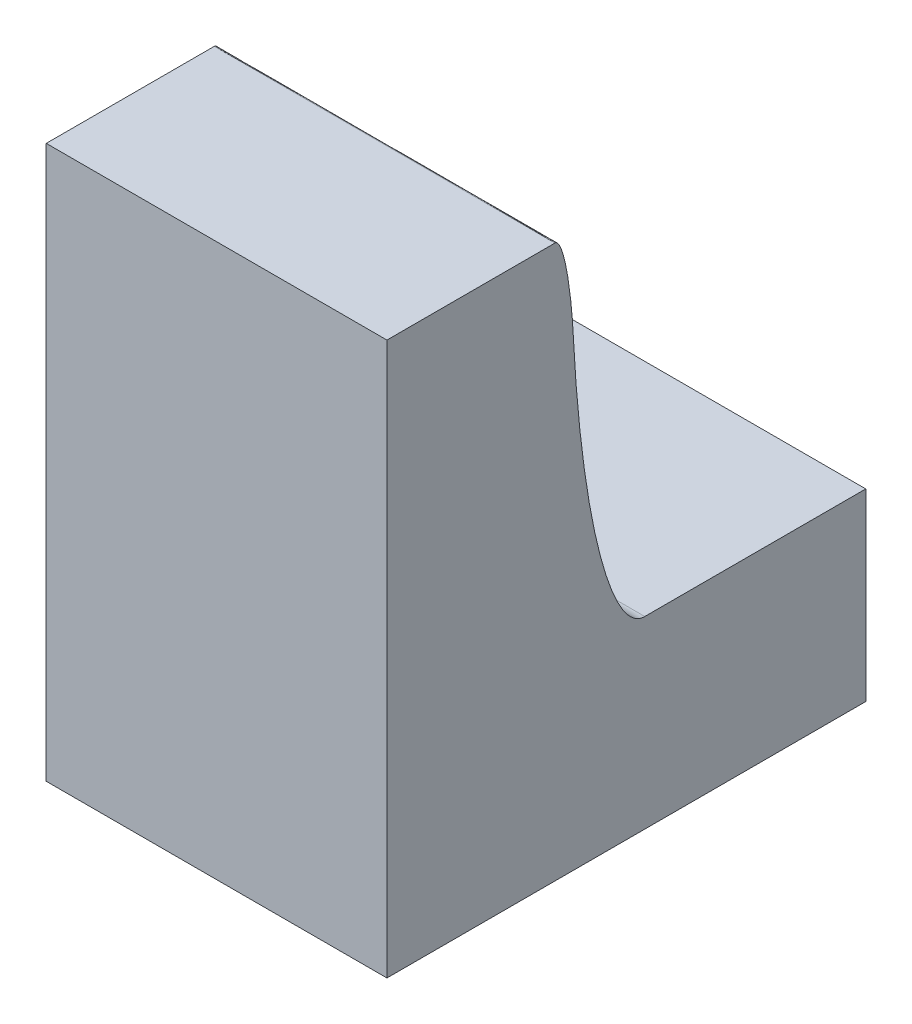
ISO-10303-21;
HEADER;
FILE_DESCRIPTION(('STEP AP214'),'2;1');
FILE_NAME('part.step','',(''),(''),'','','');
FILE_SCHEMA(('AUTOMOTIVE_DESIGN { 1 0 10303 214 1 1 1 1 }'));
ENDSEC;
DATA;
#1=APPLICATION_CONTEXT('core data for automotive mechanical design processes');
#2=APPLICATION_PROTOCOL_DEFINITION('international standard','automotive_design',2000,#1);
#3=PRODUCT_CONTEXT('',#1,'mechanical');
#4=PRODUCT('Part','Part','',(#3));
#5=PRODUCT_RELATED_PRODUCT_CATEGORY('part','',(#4));
#6=PRODUCT_DEFINITION_FORMATION('','',#4);
#7=PRODUCT_DEFINITION_CONTEXT('part definition',#1,'design');
#8=PRODUCT_DEFINITION('design','',#6,#7);
#9=PRODUCT_DEFINITION_SHAPE('','',#8);
#10=(LENGTH_UNIT() NAMED_UNIT(*) SI_UNIT(.MILLI.,.METRE.));
#11=(NAMED_UNIT(*) PLANE_ANGLE_UNIT() SI_UNIT($,.RADIAN.));
#12=(NAMED_UNIT(*) SI_UNIT($,.STERADIAN.) SOLID_ANGLE_UNIT());
#13=UNCERTAINTY_MEASURE_WITH_UNIT(LENGTH_MEASURE(1.E-05),#10,'distance_accuracy_value','');
#14=(GEOMETRIC_REPRESENTATION_CONTEXT(3) GLOBAL_UNCERTAINTY_ASSIGNED_CONTEXT((#13)) GLOBAL_UNIT_ASSIGNED_CONTEXT((#10,
#11,#12)) REPRESENTATION_CONTEXT('',''));
#15=CARTESIAN_POINT('',(0.,0.,0.));
#16=DIRECTION('',(0.,0.,1.));
#17=DIRECTION('',(1.,0.,0.));
#18=AXIS2_PLACEMENT_3D('',#15,#16,#17);
#19=CARTESIAN_POINT('',(0.,0.,26.));
#20=DIRECTION('',(0.,0.,1.));
#21=DIRECTION('',(1.,0.,0.));
#22=AXIS2_PLACEMENT_3D('',#19,#20,#21);
#23=PLANE('',#22);
#24=DIRECTION('',(-1.,0.,0.));
#25=VECTOR('',#24,1.);
#26=CARTESIAN_POINT('',(48.5,10.,26.));
#27=LINE('',#26,#25);
#28=CARTESIAN_POINT('',(67.,10.,26.));
#29=VERTEX_POINT('',#28);
#30=CARTESIAN_POINT('',(48.5,10.,26.));
#31=VERTEX_POINT('',#30);
#32=EDGE_CURVE('E110',#29,#31,#27,.T.);
#33=ORIENTED_EDGE('',*,*,#32,.F.);
#34=DIRECTION('',(0.,1.,0.));
#35=VECTOR('',#34,1.);
#36=CARTESIAN_POINT('',(67.,0.,26.));
#37=LINE('',#36,#35);
#38=CARTESIAN_POINT('',(67.,0.,26.));
#39=VERTEX_POINT('',#38);
#40=EDGE_CURVE('E104',#39,#29,#37,.T.);
#41=ORIENTED_EDGE('',*,*,#40,.F.);
#42=DIRECTION('',(1.,0.,0.));
#43=VECTOR('',#42,1.);
#44=CARTESIAN_POINT('',(0.,0.,26.));
#45=LINE('',#44,#43);
#46=CARTESIAN_POINT('',(48.5,0.,26.));
#47=VERTEX_POINT('',#46);
#48=EDGE_CURVE('E37',#47,#39,#45,.T.);
#49=ORIENTED_EDGE('',*,*,#48,.F.);
#50=DIRECTION('',(0.,-1.,0.));
#51=VECTOR('',#50,1.);
#52=CARTESIAN_POINT('',(48.5,0.,26.));
#53=LINE('',#52,#51);
#54=EDGE_CURVE('E94',#31,#47,#53,.T.);
#55=ORIENTED_EDGE('',*,*,#54,.F.);
#56=EDGE_LOOP('',(#33,#41,#49,#55));
#57=FACE_BOUND('',#56,.T.);
#58=ADVANCED_FACE('F34',(#57),#23,.F.);
#59=CARTESIAN_POINT('',(48.5,10.,52.));
#60=DIRECTION('',(0.,-1.,0.));
#61=DIRECTION('',(0.,0.,-1.));
#62=AXIS2_PLACEMENT_3D('',#59,#60,#61);
#63=PLANE('',#62);
#64=DIRECTION('',(0.,0.,-1.));
#65=VECTOR('',#64,1.);
#66=CARTESIAN_POINT('',(67.,10.,52.));
#67=LINE('',#66,#65);
#68=CARTESIAN_POINT('',(67.,10.,38.));
#69=VERTEX_POINT('',#68);
#70=EDGE_CURVE('E117',#69,#29,#67,.T.);
#71=ORIENTED_EDGE('',*,*,#70,.T.);
#72=ORIENTED_EDGE('',*,*,#32,.T.);
#73=DIRECTION('',(0.,0.,-1.));
#74=VECTOR('',#73,1.);
#75=CARTESIAN_POINT('',(48.5,10.,52.));
#76=LINE('',#75,#74);
#77=CARTESIAN_POINT('',(48.5,10.,38.));
#78=VERTEX_POINT('',#77);
#79=EDGE_CURVE('E100',#78,#31,#76,.T.);
#80=ORIENTED_EDGE('',*,*,#79,.F.);
#81=CARTESIAN_POINT('',(67.925,10.,38.));
#82=CARTESIAN_POINT('',(61.1416666666666,10.,38.));
#83=CARTESIAN_POINT('',(54.3583333333333,10.,38.));
#84=CARTESIAN_POINT('',(47.575,10.,38.));
#85=(BOUNDED_CURVE() B_SPLINE_CURVE(3,(#81,#82,#83,#84),.UNSPECIFIED.,.F.,
.F.) B_SPLINE_CURVE_WITH_KNOTS((4,4),(-0.000924999999999999,0.019425),
.UNSPECIFIED.) CURVE() GEOMETRIC_REPRESENTATION_ITEM() RATIONAL_B_SPLINE_CURVE((1.,1.,1.,1.)) REPRESENTATION_ITEM(''));
#86=EDGE_CURVE('E115',#78,#69,#85,.F.);
#87=ORIENTED_EDGE('',*,*,#86,.T.);
#88=EDGE_LOOP('',(#71,#72,#80,#87));
#89=FACE_BOUND('',#88,.T.);
#90=ADVANCED_FACE('F142',(#89),#63,.F.);
#91=CARTESIAN_POINT('',(0.,0.,10.));
#92=DIRECTION('',(0.,1.,0.));
#93=DIRECTION('',(0.,0.,1.));
#94=AXIS2_PLACEMENT_3D('',#91,#92,#93);
#95=PLANE('',#94);
#96=DIRECTION('',(0.,0.,-1.));
#97=VECTOR('',#96,1.);
#98=CARTESIAN_POINT('',(48.5,0.,52.));
#99=LINE('',#98,#97);
#100=CARTESIAN_POINT('',(48.5,0.,52.));
#101=VERTEX_POINT('',#100);
#102=EDGE_CURVE('E98',#101,#47,#99,.T.);
#103=ORIENTED_EDGE('',*,*,#102,.T.);
#104=ORIENTED_EDGE('',*,*,#48,.T.);
#105=DIRECTION('',(0.,0.,-1.));
#106=VECTOR('',#105,1.);
#107=CARTESIAN_POINT('',(67.,0.,52.));
#108=LINE('',#107,#106);
#109=CARTESIAN_POINT('',(67.,0.,52.));
#110=VERTEX_POINT('',#109);
#111=EDGE_CURVE('E114',#110,#39,#108,.T.);
#112=ORIENTED_EDGE('',*,*,#111,.F.);
#113=DIRECTION('',(1.,0.,0.));
#114=VECTOR('',#113,1.);
#115=CARTESIAN_POINT('',(48.5,0.,52.));
#116=LINE('',#115,#114);
#117=EDGE_CURVE('E112',#101,#110,#116,.T.);
#118=ORIENTED_EDGE('',*,*,#117,.F.);
#119=EDGE_LOOP('',(#103,#104,#112,#118));
#120=FACE_BOUND('',#119,.T.);
#121=ADVANCED_FACE('F111',(#120),#95,.F.);
#122=CARTESIAN_POINT('',(48.5,0.,52.));
#123=DIRECTION('',(1.,0.,0.));
#124=DIRECTION('',(0.,0.,-1.));
#125=AXIS2_PLACEMENT_3D('',#122,#123,#124);
#126=PLANE('',#125);
#127=ORIENTED_EDGE('',*,*,#79,.T.);
#128=ORIENTED_EDGE('',*,*,#54,.T.);
#129=ORIENTED_EDGE('',*,*,#102,.F.);
#130=DIRECTION('',(0.,-1.,0.));
#131=VECTOR('',#130,1.);
#132=CARTESIAN_POINT('',(48.5,0.,52.));
#133=LINE('',#132,#131);
#134=CARTESIAN_POINT('',(48.5,30.,52.));
#135=VERTEX_POINT('',#134);
#136=EDGE_CURVE('E203',#135,#101,#133,.T.);
#137=ORIENTED_EDGE('',*,*,#136,.F.);
#138=DIRECTION('',(0.,0.,1.));
#139=VECTOR('',#138,1.);
#140=CARTESIAN_POINT('',(48.5,30.,52.));
#141=LINE('',#140,#139);
#142=CARTESIAN_POINT('',(48.5,30.,42.8743013109692));
#143=VERTEX_POINT('',#142);
#144=EDGE_CURVE('E11',#143,#135,#141,.T.);
#145=ORIENTED_EDGE('',*,*,#144,.F.);
#146=CARTESIAN_POINT('',(48.5,25.0510118754307,41.8756032642306));
#147=CARTESIAN_POINT('',(48.5,29.9999999999986,42.1283895458696));
#148=CARTESIAN_POINT('',(48.5,30.,42.8743013109692));
#149=(BOUNDED_CURVE() B_SPLINE_CURVE(2,(#146,#147,#148),.UNSPECIFIED.,.F.,
.F.) B_SPLINE_CURVE_WITH_KNOTS((3,3),(0.,1.),
.UNSPECIFIED.) CURVE() GEOMETRIC_REPRESENTATION_ITEM() RATIONAL_B_SPLINE_CURVE((1.,
0.72491788342915,1.)) REPRESENTATION_ITEM(''));
#150=CARTESIAN_POINT('',(48.5,25.0510116808237,41.8756070670597));
#151=VERTEX_POINT('',#150);
#152=EDGE_CURVE('E293',#143,#151,#149,.F.);
#153=ORIENTED_EDGE('',*,*,#152,.T.);
#154=CARTESIAN_POINT('',(48.5,10.,38.));
#155=CARTESIAN_POINT('',(48.5,10.,42.));
#156=CARTESIAN_POINT('',(48.5,30.,42.));
#157=(BOUNDED_CURVE() B_SPLINE_CURVE(2,(#154,#155,#156),.UNSPECIFIED.,.F.,
.F.) B_SPLINE_CURVE_WITH_KNOTS((3,3),(0.,1.),
.UNSPECIFIED.) CURVE() GEOMETRIC_REPRESENTATION_ITEM() RATIONAL_B_SPLINE_CURVE((1.,
0.707106781186548,1.)) REPRESENTATION_ITEM(''));
#158=EDGE_CURVE('E119',#151,#78,#157,.F.);
#159=ORIENTED_EDGE('',*,*,#158,.T.);
#160=EDGE_LOOP('',(#127,#128,#129,#137,#145,#153,#159));
#161=FACE_BOUND('',#160,.T.);
#162=ADVANCED_FACE('F96',(#161),#126,.F.);
#163=CARTESIAN_POINT('',(67.,0.,52.));
#164=DIRECTION('',(-1.,0.,0.));
#165=DIRECTION('',(0.,0.,1.));
#166=AXIS2_PLACEMENT_3D('',#163,#164,#165);
#167=PLANE('',#166);
#168=ORIENTED_EDGE('',*,*,#111,.T.);
#169=ORIENTED_EDGE('',*,*,#40,.T.);
#170=ORIENTED_EDGE('',*,*,#70,.F.);
#171=CARTESIAN_POINT('',(67.,30.,42.));
#172=CARTESIAN_POINT('',(67.,10.,42.));
#173=CARTESIAN_POINT('',(67.,10.,38.));
#174=(BOUNDED_CURVE() B_SPLINE_CURVE(2,(#171,#172,#173),.UNSPECIFIED.,.F.,
.F.) B_SPLINE_CURVE_WITH_KNOTS((3,3),(0.,1.),
.UNSPECIFIED.) CURVE() GEOMETRIC_REPRESENTATION_ITEM() RATIONAL_B_SPLINE_CURVE((1.,
0.707106781186548,1.)) REPRESENTATION_ITEM(''));
#175=CARTESIAN_POINT('',(67.,25.0510116842867,41.8756069960222));
#176=VERTEX_POINT('',#175);
#177=EDGE_CURVE('E191',#69,#176,#174,.F.);
#178=ORIENTED_EDGE('',*,*,#177,.T.);
#179=CARTESIAN_POINT('',(67.,30.,42.8743013109748));
#180=CARTESIAN_POINT('',(67.,30.0000000000014,42.1283895458668));
#181=CARTESIAN_POINT('',(67.,25.0510118754324,41.8756032642307));
#182=(BOUNDED_CURVE() B_SPLINE_CURVE(2,(#179,#180,#181),.UNSPECIFIED.,.F.,
.F.) B_SPLINE_CURVE_WITH_KNOTS((3,3),(0.,1.),
.UNSPECIFIED.) CURVE() GEOMETRIC_REPRESENTATION_ITEM() RATIONAL_B_SPLINE_CURVE((1.,
0.72491788342915,1.)) REPRESENTATION_ITEM(''));
#183=CARTESIAN_POINT('',(67.,30.,42.8743013109748));
#184=VERTEX_POINT('',#183);
#185=EDGE_CURVE('E268',#176,#184,#182,.F.);
#186=ORIENTED_EDGE('',*,*,#185,.T.);
#187=DIRECTION('',(0.,0.,-1.));
#188=VECTOR('',#187,1.);
#189=CARTESIAN_POINT('',(67.,30.,52.));
#190=LINE('',#189,#188);
#191=CARTESIAN_POINT('',(67.,30.,52.));
#192=VERTEX_POINT('',#191);
#193=EDGE_CURVE('E196',#192,#184,#190,.T.);
#194=ORIENTED_EDGE('',*,*,#193,.F.);
#195=DIRECTION('',(0.,1.,0.));
#196=VECTOR('',#195,1.);
#197=CARTESIAN_POINT('',(67.,0.,52.));
#198=LINE('',#197,#196);
#199=EDGE_CURVE('E56',#110,#192,#198,.T.);
#200=ORIENTED_EDGE('',*,*,#199,.F.);
#201=EDGE_LOOP('',(#168,#169,#170,#178,#186,#194,#200));
#202=FACE_BOUND('',#201,.T.);
#203=ADVANCED_FACE('F152',(#202),#167,.F.);
#204=CARTESIAN_POINT('',(0.,0.,52.));
#205=DIRECTION('',(0.,0.,-1.));
#206=DIRECTION('',(-1.,0.,0.));
#207=AXIS2_PLACEMENT_3D('',#204,#205,#206);
#208=PLANE('',#207);
#209=ORIENTED_EDGE('',*,*,#136,.T.);
#210=ORIENTED_EDGE('',*,*,#117,.T.);
#211=ORIENTED_EDGE('',*,*,#199,.T.);
#212=DIRECTION('',(1.,0.,0.));
#213=VECTOR('',#212,1.);
#214=CARTESIAN_POINT('',(48.5,30.,52.));
#215=LINE('',#214,#213);
#216=EDGE_CURVE('E42',#135,#192,#215,.T.);
#217=ORIENTED_EDGE('',*,*,#216,.F.);
#218=EDGE_LOOP('',(#209,#210,#211,#217));
#219=FACE_BOUND('',#218,.T.);
#220=ADVANCED_FACE('F154',(#219),#208,.F.);
#221=CARTESIAN_POINT('',(0.,30.,0.));
#222=DIRECTION('',(0.,-1.,0.));
#223=DIRECTION('',(0.,0.,-1.));
#224=AXIS2_PLACEMENT_3D('',#221,#222,#223);
#225=PLANE('',#224);
#226=ORIENTED_EDGE('',*,*,#193,.T.);
#227=CARTESIAN_POINT('',(47.575,30.,42.874301310972));
#228=CARTESIAN_POINT('',(54.3583333333333,30.,42.8743013109485));
#229=CARTESIAN_POINT('',(61.1416666666667,30.,42.8743013109955));
#230=CARTESIAN_POINT('',(67.925,30.,42.874301310972));
#231=(BOUNDED_CURVE() B_SPLINE_CURVE(3,(#227,#228,#229,#230),.UNSPECIFIED.,.F.,
.F.) B_SPLINE_CURVE_WITH_KNOTS((4,4),(-0.010175,0.010175),
.UNSPECIFIED.) CURVE() GEOMETRIC_REPRESENTATION_ITEM() RATIONAL_B_SPLINE_CURVE((1.,1.,1.,1.)) REPRESENTATION_ITEM(''));
#232=EDGE_CURVE('E180',#184,#143,#231,.F.);
#233=ORIENTED_EDGE('',*,*,#232,.T.);
#234=ORIENTED_EDGE('',*,*,#144,.T.);
#235=ORIENTED_EDGE('',*,*,#216,.T.);
#236=EDGE_LOOP('',(#226,#233,#234,#235));
#237=FACE_BOUND('',#236,.T.);
#238=ADVANCED_FACE('F157',(#237),#225,.F.);
#239=CARTESIAN_POINT('',(47.575,10.,38.));
#240=CARTESIAN_POINT('',(54.3583333333333,10.,38.));
#241=CARTESIAN_POINT('',(61.1416666666666,10.,38.));
#242=CARTESIAN_POINT('',(67.925,10.,38.));
#243=CARTESIAN_POINT('',(47.575,10.,42.));
#244=CARTESIAN_POINT('',(54.3583333333333,10.,42.));
#245=CARTESIAN_POINT('',(61.1416666666667,10.,42.));
#246=CARTESIAN_POINT('',(67.925,10.,42.));
#247=CARTESIAN_POINT('',(47.575,30.,42.));
#248=CARTESIAN_POINT('',(54.3583333333333,30.,42.));
#249=CARTESIAN_POINT('',(61.1416666666666,30.,42.));
#250=CARTESIAN_POINT('',(67.925,30.,42.));
#251=(BOUNDED_SURFACE() B_SPLINE_SURFACE(2,3,((#239,#240,#241,#242),(#243,#244,#245,#246),(#247,
#248,#249,#250)),.UNSPECIFIED.,.F.,.F.,.F.) B_SPLINE_SURFACE_WITH_KNOTS((3,3),(4,4),(0.,1.),
(-0.000924999999999999,0.019425),
.UNSPECIFIED.) GEOMETRIC_REPRESENTATION_ITEM() RATIONAL_B_SPLINE_SURFACE(((1.,1.,1.,1.),
(0.707106781186548,0.707106781186548,0.707106781186548,0.707106781186548),(1.,1.,1.,1.))) REPRESENTATION_ITEM('') SURFACE());
#252=CARTESIAN_POINT('',(47.575,25.0510118754307,41.8756032642306));
#253=CARTESIAN_POINT('',(54.3583333333333,25.0510118754307,41.8756032642306));
#254=CARTESIAN_POINT('',(61.1416666666667,25.0510118754307,41.8756032642306));
#255=CARTESIAN_POINT('',(67.925,25.0510118754307,41.8756032642306));
#256=(BOUNDED_CURVE() B_SPLINE_CURVE(3,(#252,#253,#254,#255),.UNSPECIFIED.,.F.,
.F.) B_SPLINE_CURVE_WITH_KNOTS((4,4),(-0.000924999999999999,0.019425),
.UNSPECIFIED.) CURVE() GEOMETRIC_REPRESENTATION_ITEM() RATIONAL_B_SPLINE_CURVE((0.917755188622373,
0.917755188622373,0.917755188622373,0.917755188622373)) REPRESENTATION_ITEM(''));
#257=EDGE_CURVE('E245',#151,#176,#256,.T.);
#258=ORIENTED_EDGE('',*,*,#158,.F.);
#259=ORIENTED_EDGE('',*,*,#257,.T.);
#260=ORIENTED_EDGE('',*,*,#177,.F.);
#261=ORIENTED_EDGE('',*,*,#86,.F.);
#262=EDGE_LOOP('',(#258,#259,#260,#261));
#263=FACE_BOUND('',#262,.T.);
#264=ADVANCED_FACE('F161',(#263),#251,.T.);
#265=CARTESIAN_POINT('',(47.575,25.0510118754308,41.8756032642306));
#266=CARTESIAN_POINT('',(54.3583333333335,25.0510118754296,41.8756032642305));
#267=CARTESIAN_POINT('',(61.1416666666666,25.0510118754437,41.8756032642313));
#268=CARTESIAN_POINT('',(67.925,25.0510118754308,41.8756032642306));
#269=CARTESIAN_POINT('',(47.575,30.,42.1283895458727));
#270=CARTESIAN_POINT('',(54.3583333333334,29.9999999999882,42.1283895458492));
#271=CARTESIAN_POINT('',(61.1416666666667,30.0000000000118,42.1283895458257));
#272=CARTESIAN_POINT('',(67.925,30.,42.1283895458727));
#273=CARTESIAN_POINT('',(47.575,30.,42.874301310972));
#274=CARTESIAN_POINT('',(54.3583333333333,30.,42.8743013109485));
#275=CARTESIAN_POINT('',(61.1416666666667,30.,42.8743013109955));
#276=CARTESIAN_POINT('',(67.925,30.,42.874301310972));
#277=(BOUNDED_SURFACE() B_SPLINE_SURFACE(2,3,((#265,#266,#267,#268),(#269,#270,#271,#272),(#273,
#274,#275,#276)),.UNSPECIFIED.,.F.,.F.,.F.) B_SPLINE_SURFACE_WITH_KNOTS((3,3),(4,4),(0.,1.),
(-0.010175,0.010175),
.UNSPECIFIED.) GEOMETRIC_REPRESENTATION_ITEM() RATIONAL_B_SPLINE_SURFACE(((1.,1.,1.,1.),
(0.72491788342915,0.72491788342915,0.72491788342915,0.72491788342915),(1.,1.,1.,1.))) REPRESENTATION_ITEM('') SURFACE());
#278=ORIENTED_EDGE('',*,*,#185,.F.);
#279=ORIENTED_EDGE('',*,*,#257,.F.);
#280=ORIENTED_EDGE('',*,*,#152,.F.);
#281=ORIENTED_EDGE('',*,*,#232,.F.);
#282=EDGE_LOOP('',(#278,#279,#280,#281));
#283=FACE_BOUND('',#282,.T.);
#284=ADVANCED_FACE('F163',(#283),#277,.T.);
#285=CLOSED_SHELL('',(#58,#90,#121,#162,#203,#220,#238,#264,#284));
#286=MANIFOLD_SOLID_BREP('B2',#285);
#287=ADVANCED_BREP_SHAPE_REPRESENTATION('',(#18,#286),#14);
#288=SHAPE_DEFINITION_REPRESENTATION(#9,#287);
ENDSEC;
END-ISO-10303-21;
